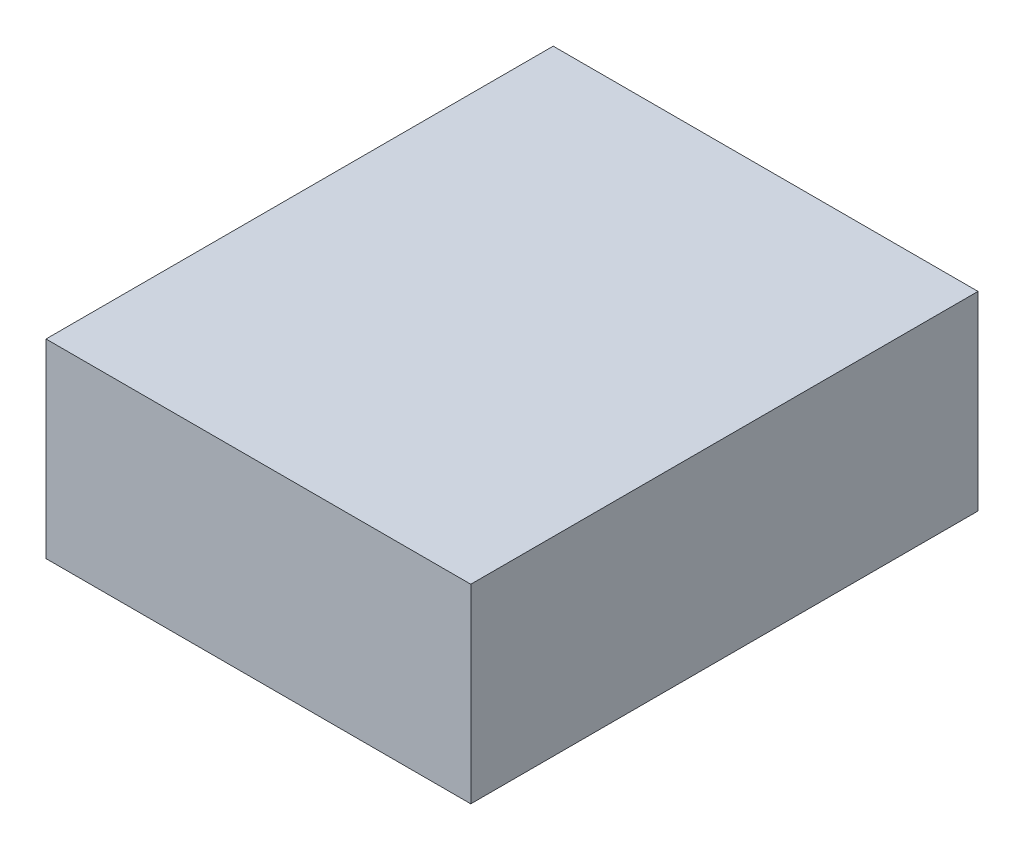
ISO-10303-21;
HEADER;
FILE_DESCRIPTION(('STEP AP214'),'2;1');
FILE_NAME('part.step','',(''),(''),'','','');
FILE_SCHEMA(('AUTOMOTIVE_DESIGN { 1 0 10303 214 1 1 1 1 }'));
ENDSEC;
DATA;
#1=APPLICATION_CONTEXT('core data for automotive mechanical design processes');
#2=APPLICATION_PROTOCOL_DEFINITION('international standard','automotive_design',2000,#1);
#3=PRODUCT_CONTEXT('',#1,'mechanical');
#4=PRODUCT('Part','Part','',(#3));
#5=PRODUCT_RELATED_PRODUCT_CATEGORY('part','',(#4));
#6=PRODUCT_DEFINITION_FORMATION('','',#4);
#7=PRODUCT_DEFINITION_CONTEXT('part definition',#1,'design');
#8=PRODUCT_DEFINITION('design','',#6,#7);
#9=PRODUCT_DEFINITION_SHAPE('','',#8);
#10=(LENGTH_UNIT() NAMED_UNIT(*) SI_UNIT(.MILLI.,.METRE.));
#11=(NAMED_UNIT(*) PLANE_ANGLE_UNIT() SI_UNIT($,.RADIAN.));
#12=(NAMED_UNIT(*) SI_UNIT($,.STERADIAN.) SOLID_ANGLE_UNIT());
#13=UNCERTAINTY_MEASURE_WITH_UNIT(LENGTH_MEASURE(1.E-05),#10,'distance_accuracy_value','');
#14=(GEOMETRIC_REPRESENTATION_CONTEXT(3) GLOBAL_UNCERTAINTY_ASSIGNED_CONTEXT((#13)) GLOBAL_UNIT_ASSIGNED_CONTEXT((#10,
#11,#12)) REPRESENTATION_CONTEXT('',''));
#15=CARTESIAN_POINT('',(0.,0.,0.));
#16=DIRECTION('',(0.,0.,1.));
#17=DIRECTION('',(1.,0.,0.));
#18=AXIS2_PLACEMENT_3D('',#15,#16,#17);
#19=CARTESIAN_POINT('',(8.509,7.62,-10.16));
#20=DIRECTION('',(-1.,0.,0.));
#21=DIRECTION('',(0.,0.,1.));
#22=AXIS2_PLACEMENT_3D('',#19,#20,#21);
#23=PLANE('',#22);
#24=DIRECTION('',(0.,0.,-1.));
#25=VECTOR('',#24,1.);
#26=CARTESIAN_POINT('',(8.509,0.,-10.16));
#27=LINE('',#26,#25);
#28=CARTESIAN_POINT('',(8.509,0.,10.16));
#29=VERTEX_POINT('',#28);
#30=CARTESIAN_POINT('',(8.509,0.,-10.16));
#31=VERTEX_POINT('',#30);
#32=EDGE_CURVE('E94',#29,#31,#27,.T.);
#33=ORIENTED_EDGE('',*,*,#32,.T.);
#34=DIRECTION('',(0.,-1.,0.));
#35=VECTOR('',#34,1.);
#36=CARTESIAN_POINT('',(8.509,7.62,-10.16));
#37=LINE('',#36,#35);
#38=CARTESIAN_POINT('',(8.509,7.62,-10.16));
#39=VERTEX_POINT('',#38);
#40=EDGE_CURVE('E11',#39,#31,#37,.T.);
#41=ORIENTED_EDGE('',*,*,#40,.F.);
#42=DIRECTION('',(0.,0.,-1.));
#43=VECTOR('',#42,1.);
#44=CARTESIAN_POINT('',(8.509,7.62,-10.16));
#45=LINE('',#44,#43);
#46=CARTESIAN_POINT('',(8.509,7.62,10.16));
#47=VERTEX_POINT('',#46);
#48=EDGE_CURVE('E82',#47,#39,#45,.T.);
#49=ORIENTED_EDGE('',*,*,#48,.F.);
#50=DIRECTION('',(0.,-1.,0.));
#51=VECTOR('',#50,1.);
#52=CARTESIAN_POINT('',(8.509,7.62,10.16));
#53=LINE('',#52,#51);
#54=EDGE_CURVE('E90',#47,#29,#53,.T.);
#55=ORIENTED_EDGE('',*,*,#54,.T.);
#56=EDGE_LOOP('',(#33,#41,#49,#55));
#57=FACE_BOUND('',#56,.T.);
#58=ADVANCED_FACE('F31',(#57),#23,.F.);
#59=CARTESIAN_POINT('',(-8.509,7.62,-10.16));
#60=DIRECTION('',(0.,0.,1.));
#61=DIRECTION('',(1.,0.,0.));
#62=AXIS2_PLACEMENT_3D('',#59,#60,#61);
#63=PLANE('',#62);
#64=DIRECTION('',(-1.,0.,0.));
#65=VECTOR('',#64,1.);
#66=CARTESIAN_POINT('',(-8.509,0.,-10.16));
#67=LINE('',#66,#65);
#68=CARTESIAN_POINT('',(-8.509,0.,-10.16));
#69=VERTEX_POINT('',#68);
#70=EDGE_CURVE('E86',#31,#69,#67,.T.);
#71=ORIENTED_EDGE('',*,*,#70,.T.);
#72=DIRECTION('',(0.,-1.,0.));
#73=VECTOR('',#72,1.);
#74=CARTESIAN_POINT('',(-8.509,7.62,-10.16));
#75=LINE('',#74,#73);
#76=CARTESIAN_POINT('',(-8.509,7.62,-10.16));
#77=VERTEX_POINT('',#76);
#78=EDGE_CURVE('E39',#77,#69,#75,.T.);
#79=ORIENTED_EDGE('',*,*,#78,.F.);
#80=DIRECTION('',(-1.,0.,0.));
#81=VECTOR('',#80,1.);
#82=CARTESIAN_POINT('',(-8.509,7.62,-10.16));
#83=LINE('',#82,#81);
#84=EDGE_CURVE('E77',#39,#77,#83,.T.);
#85=ORIENTED_EDGE('',*,*,#84,.F.);
#86=ORIENTED_EDGE('',*,*,#40,.T.);
#87=EDGE_LOOP('',(#71,#79,#85,#86));
#88=FACE_BOUND('',#87,.T.);
#89=ADVANCED_FACE('F85',(#88),#63,.F.);
#90=CARTESIAN_POINT('',(-8.509,7.62,-10.16));
#91=DIRECTION('',(1.,0.,0.));
#92=DIRECTION('',(0.,0.,-1.));
#93=AXIS2_PLACEMENT_3D('',#90,#91,#92);
#94=PLANE('',#93);
#95=DIRECTION('',(0.,0.,1.));
#96=VECTOR('',#95,1.);
#97=CARTESIAN_POINT('',(-8.509,0.,-10.16));
#98=LINE('',#97,#96);
#99=CARTESIAN_POINT('',(-8.509,0.,10.16));
#100=VERTEX_POINT('',#99);
#101=EDGE_CURVE('E64',#69,#100,#98,.T.);
#102=ORIENTED_EDGE('',*,*,#101,.T.);
#103=DIRECTION('',(0.,-1.,0.));
#104=VECTOR('',#103,1.);
#105=CARTESIAN_POINT('',(-8.509,7.62,10.16));
#106=LINE('',#105,#104);
#107=CARTESIAN_POINT('',(-8.509,7.62,10.16));
#108=VERTEX_POINT('',#107);
#109=EDGE_CURVE('E87',#108,#100,#106,.T.);
#110=ORIENTED_EDGE('',*,*,#109,.F.);
#111=DIRECTION('',(0.,0.,1.));
#112=VECTOR('',#111,1.);
#113=CARTESIAN_POINT('',(-8.509,7.62,-10.16));
#114=LINE('',#113,#112);
#115=EDGE_CURVE('E80',#77,#108,#114,.T.);
#116=ORIENTED_EDGE('',*,*,#115,.F.);
#117=ORIENTED_EDGE('',*,*,#78,.T.);
#118=EDGE_LOOP('',(#102,#110,#116,#117));
#119=FACE_BOUND('',#118,.T.);
#120=ADVANCED_FACE('F88',(#119),#94,.F.);
#121=CARTESIAN_POINT('',(-8.509,7.62,10.16));
#122=DIRECTION('',(0.,0.,-1.));
#123=DIRECTION('',(-1.,0.,0.));
#124=AXIS2_PLACEMENT_3D('',#121,#122,#123);
#125=PLANE('',#124);
#126=DIRECTION('',(1.,0.,0.));
#127=VECTOR('',#126,1.);
#128=CARTESIAN_POINT('',(-8.509,0.,10.16));
#129=LINE('',#128,#127);
#130=EDGE_CURVE('E70',#100,#29,#129,.T.);
#131=ORIENTED_EDGE('',*,*,#130,.T.);
#132=ORIENTED_EDGE('',*,*,#54,.F.);
#133=DIRECTION('',(1.,0.,0.));
#134=VECTOR('',#133,1.);
#135=CARTESIAN_POINT('',(-8.509,7.62,10.16));
#136=LINE('',#135,#134);
#137=EDGE_CURVE('E47',#108,#47,#136,.T.);
#138=ORIENTED_EDGE('',*,*,#137,.F.);
#139=ORIENTED_EDGE('',*,*,#109,.T.);
#140=EDGE_LOOP('',(#131,#132,#138,#139));
#141=FACE_BOUND('',#140,.T.);
#142=ADVANCED_FACE('F101',(#141),#125,.F.);
#143=CARTESIAN_POINT('',(8.50900000000001,7.62,10.16));
#144=DIRECTION('',(0.,1.,0.));
#145=DIRECTION('',(0.,0.,1.));
#146=AXIS2_PLACEMENT_3D('',#143,#144,#145);
#147=PLANE('',#146);
#148=ORIENTED_EDGE('',*,*,#48,.T.);
#149=ORIENTED_EDGE('',*,*,#84,.T.);
#150=ORIENTED_EDGE('',*,*,#115,.T.);
#151=ORIENTED_EDGE('',*,*,#137,.T.);
#152=EDGE_LOOP('',(#148,#149,#150,#151));
#153=FACE_BOUND('',#152,.T.);
#154=ADVANCED_FACE('F78',(#153),#147,.T.);
#155=CARTESIAN_POINT('',(8.50900000000001,0.,10.16));
#156=DIRECTION('',(0.,1.,0.));
#157=DIRECTION('',(0.,0.,1.));
#158=AXIS2_PLACEMENT_3D('',#155,#156,#157);
#159=PLANE('',#158);
#160=ORIENTED_EDGE('',*,*,#32,.F.);
#161=ORIENTED_EDGE('',*,*,#130,.F.);
#162=ORIENTED_EDGE('',*,*,#101,.F.);
#163=ORIENTED_EDGE('',*,*,#70,.F.);
#164=EDGE_LOOP('',(#160,#161,#162,#163));
#165=FACE_BOUND('',#164,.T.);
#166=ADVANCED_FACE('F104',(#165),#159,.F.);
#167=CLOSED_SHELL('',(#58,#89,#120,#142,#154,#166));
#168=MANIFOLD_SOLID_BREP('B2',#167);
#169=ADVANCED_BREP_SHAPE_REPRESENTATION('',(#18,#168),#14);
#170=SHAPE_DEFINITION_REPRESENTATION(#9,#169);
ENDSEC;
END-ISO-10303-21;
